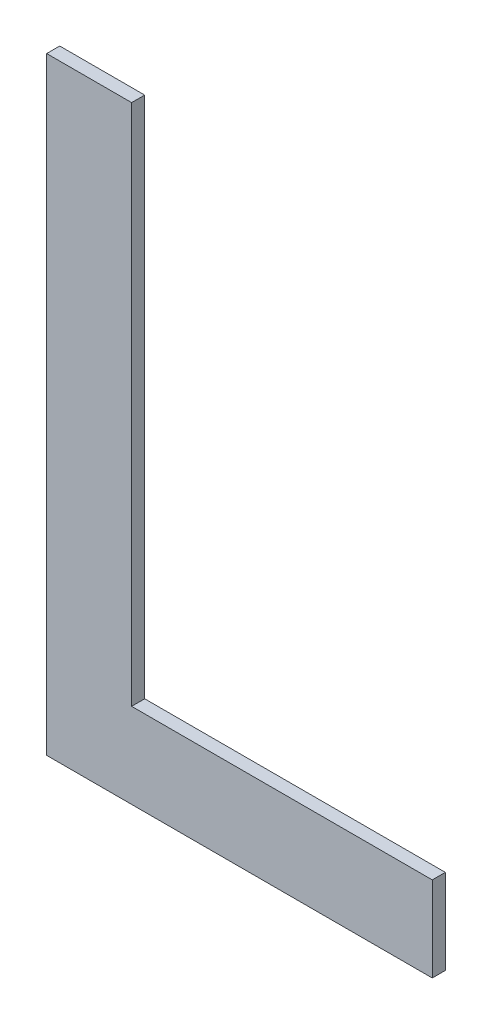
ISO-10303-21;
HEADER;
FILE_DESCRIPTION(('STEP AP214'),'2;1');
FILE_NAME('part.step','',(''),(''),'','','');
FILE_SCHEMA(('AUTOMOTIVE_DESIGN { 1 0 10303 214 1 1 1 1 }'));
ENDSEC;
DATA;
#1=APPLICATION_CONTEXT('core data for automotive mechanical design processes');
#2=APPLICATION_PROTOCOL_DEFINITION('international standard','automotive_design',2000,#1);
#3=PRODUCT_CONTEXT('',#1,'mechanical');
#4=PRODUCT('Part','Part','',(#3));
#5=PRODUCT_RELATED_PRODUCT_CATEGORY('part','',(#4));
#6=PRODUCT_DEFINITION_FORMATION('','',#4);
#7=PRODUCT_DEFINITION_CONTEXT('part definition',#1,'design');
#8=PRODUCT_DEFINITION('design','',#6,#7);
#9=PRODUCT_DEFINITION_SHAPE('','',#8);
#10=(LENGTH_UNIT() NAMED_UNIT(*) SI_UNIT(.MILLI.,.METRE.));
#11=(NAMED_UNIT(*) PLANE_ANGLE_UNIT() SI_UNIT($,.RADIAN.));
#12=(NAMED_UNIT(*) SI_UNIT($,.STERADIAN.) SOLID_ANGLE_UNIT());
#13=UNCERTAINTY_MEASURE_WITH_UNIT(LENGTH_MEASURE(1.E-05),#10,'distance_accuracy_value','');
#14=(GEOMETRIC_REPRESENTATION_CONTEXT(3) GLOBAL_UNCERTAINTY_ASSIGNED_CONTEXT((#13)) GLOBAL_UNIT_ASSIGNED_CONTEXT((#10,
#11,#12)) REPRESENTATION_CONTEXT('',''));
#15=CARTESIAN_POINT('',(0.,0.,0.));
#16=DIRECTION('',(0.,0.,1.));
#17=DIRECTION('',(1.,0.,0.));
#18=AXIS2_PLACEMENT_3D('',#15,#16,#17);
#19=CARTESIAN_POINT('',(-0.29500068,0.46500034,0.));
#20=DIRECTION('',(0.,0.,-1.));
#21=DIRECTION('',(0.,-1.,0.));
#22=AXIS2_PLACEMENT_3D('',#19,#20,#21);
#23=PLANE('',#22);
#24=DIRECTION('',(-1.,0.,0.));
#25=VECTOR('',#24,1.);
#26=CARTESIAN_POINT('',(-0.29500068,-0.4649978,0.));
#27=LINE('',#26,#25);
#28=CARTESIAN_POINT('',(0.29500068,-0.4649978,0.));
#29=VERTEX_POINT('',#28);
#30=CARTESIAN_POINT('',(-0.29500068,-0.4649978,0.));
#31=VERTEX_POINT('',#30);
#32=EDGE_CURVE('E25',#29,#31,#27,.T.);
#33=ORIENTED_EDGE('',*,*,#32,.T.);
#34=DIRECTION('',(0.,1.,0.));
#35=VECTOR('',#34,1.);
#36=CARTESIAN_POINT('',(-0.29500068,0.46500034,0.));
#37=LINE('',#36,#35);
#38=CARTESIAN_POINT('',(-0.29500068,0.46500034,0.));
#39=VERTEX_POINT('',#38);
#40=EDGE_CURVE('E11',#31,#39,#37,.T.);
#41=ORIENTED_EDGE('',*,*,#40,.T.);
#42=DIRECTION('',(1.,0.,0.));
#43=VECTOR('',#42,1.);
#44=CARTESIAN_POINT('',(-0.29500068,0.46500034,0.));
#45=LINE('',#44,#43);
#46=CARTESIAN_POINT('',(-0.16500094,0.46500034,0.));
#47=VERTEX_POINT('',#46);
#48=EDGE_CURVE('E84',#39,#47,#45,.T.);
#49=ORIENTED_EDGE('',*,*,#48,.T.);
#50=DIRECTION('',(0.,-1.,0.));
#51=VECTOR('',#50,1.);
#52=CARTESIAN_POINT('',(-0.16500094,0.46500034,0.));
#53=LINE('',#52,#51);
#54=CARTESIAN_POINT('',(-0.16500094,-0.33499806,0.));
#55=VERTEX_POINT('',#54);
#56=EDGE_CURVE('E82',#47,#55,#53,.T.);
#57=ORIENTED_EDGE('',*,*,#56,.T.);
#58=DIRECTION('',(1.,0.,0.));
#59=VECTOR('',#58,1.);
#60=CARTESIAN_POINT('',(-0.29500068,-0.33499806,0.));
#61=LINE('',#60,#59);
#62=CARTESIAN_POINT('',(0.29500068,-0.33499806,0.));
#63=VERTEX_POINT('',#62);
#64=EDGE_CURVE('E68',#55,#63,#61,.T.);
#65=ORIENTED_EDGE('',*,*,#64,.T.);
#66=DIRECTION('',(0.,-1.,0.));
#67=VECTOR('',#66,1.);
#68=CARTESIAN_POINT('',(0.29500068,0.46500034,0.));
#69=LINE('',#68,#67);
#70=EDGE_CURVE('E120',#63,#29,#69,.T.);
#71=ORIENTED_EDGE('',*,*,#70,.T.);
#72=EDGE_LOOP('',(#33,#41,#49,#57,#65,#71));
#73=FACE_BOUND('',#72,.T.);
#74=ADVANCED_FACE('F17',(#73),#23,.T.);
#75=CARTESIAN_POINT('',(-0.29500068,0.46500034,0.));
#76=DIRECTION('',(1.,0.,0.));
#77=DIRECTION('',(0.,1.,0.));
#78=AXIS2_PLACEMENT_3D('',#75,#76,#77);
#79=PLANE('',#78);
#80=DIRECTION('',(0.,0.,-1.));
#81=VECTOR('',#80,1.);
#82=CARTESIAN_POINT('',(-0.29500068,-0.4649978,0.));
#83=LINE('',#82,#81);
#84=CARTESIAN_POINT('',(-0.29500068,-0.4649978,0.02));
#85=VERTEX_POINT('',#84);
#86=EDGE_CURVE('E127',#85,#31,#83,.T.);
#87=ORIENTED_EDGE('',*,*,#86,.F.);
#88=DIRECTION('',(0.,-1.,0.));
#89=VECTOR('',#88,1.);
#90=CARTESIAN_POINT('',(-0.29500068,0.46500034,0.02));
#91=LINE('',#90,#89);
#92=CARTESIAN_POINT('',(-0.29500068,0.46500034,0.02));
#93=VERTEX_POINT('',#92);
#94=EDGE_CURVE('E109',#93,#85,#91,.T.);
#95=ORIENTED_EDGE('',*,*,#94,.F.);
#96=DIRECTION('',(0.,0.,1.));
#97=VECTOR('',#96,1.);
#98=CARTESIAN_POINT('',(-0.29500068,0.46500034,0.));
#99=LINE('',#98,#97);
#100=EDGE_CURVE('E112',#39,#93,#99,.T.);
#101=ORIENTED_EDGE('',*,*,#100,.F.);
#102=ORIENTED_EDGE('',*,*,#40,.F.);
#103=EDGE_LOOP('',(#87,#95,#101,#102));
#104=FACE_BOUND('',#103,.T.);
#105=ADVANCED_FACE('F138',(#104),#79,.F.);
#106=CARTESIAN_POINT('',(-0.29500068,-0.4649978,0.));
#107=DIRECTION('',(0.,1.,0.));
#108=DIRECTION('',(1.,0.,0.));
#109=AXIS2_PLACEMENT_3D('',#106,#107,#108);
#110=PLANE('',#109);
#111=DIRECTION('',(0.,0.,-1.));
#112=VECTOR('',#111,1.);
#113=CARTESIAN_POINT('',(0.29500068,-0.4649978,0.));
#114=LINE('',#113,#112);
#115=CARTESIAN_POINT('',(0.29500068,-0.4649978,0.02));
#116=VERTEX_POINT('',#115);
#117=EDGE_CURVE('E79',#116,#29,#114,.T.);
#118=ORIENTED_EDGE('',*,*,#117,.F.);
#119=DIRECTION('',(1.,0.,0.));
#120=VECTOR('',#119,1.);
#121=CARTESIAN_POINT('',(-0.29500068,-0.4649978,0.02));
#122=LINE('',#121,#120);
#123=EDGE_CURVE('E136',#85,#116,#122,.T.);
#124=ORIENTED_EDGE('',*,*,#123,.F.);
#125=ORIENTED_EDGE('',*,*,#86,.T.);
#126=ORIENTED_EDGE('',*,*,#32,.F.);
#127=EDGE_LOOP('',(#118,#124,#125,#126));
#128=FACE_BOUND('',#127,.T.);
#129=ADVANCED_FACE('F133',(#128),#110,.F.);
#130=CARTESIAN_POINT('',(0.29500068,-0.4649978,0.));
#131=DIRECTION('',(-1.,0.,0.));
#132=DIRECTION('',(0.,0.,1.));
#133=AXIS2_PLACEMENT_3D('',#130,#131,#132);
#134=PLANE('',#133);
#135=DIRECTION('',(0.,0.,-1.));
#136=VECTOR('',#135,1.);
#137=CARTESIAN_POINT('',(0.29500068,-0.33499806,0.));
#138=LINE('',#137,#136);
#139=CARTESIAN_POINT('',(0.29500068,-0.33499806,0.02));
#140=VERTEX_POINT('',#139);
#141=EDGE_CURVE('E76',#140,#63,#138,.T.);
#142=ORIENTED_EDGE('',*,*,#141,.F.);
#143=DIRECTION('',(0.,1.,0.));
#144=VECTOR('',#143,1.);
#145=CARTESIAN_POINT('',(0.29500068,-0.4649978,0.02));
#146=LINE('',#145,#144);
#147=EDGE_CURVE('E162',#116,#140,#146,.T.);
#148=ORIENTED_EDGE('',*,*,#147,.F.);
#149=ORIENTED_EDGE('',*,*,#117,.T.);
#150=ORIENTED_EDGE('',*,*,#70,.F.);
#151=EDGE_LOOP('',(#142,#148,#149,#150));
#152=FACE_BOUND('',#151,.T.);
#153=ADVANCED_FACE('F163',(#152),#134,.F.);
#154=CARTESIAN_POINT('',(0.29500068,-0.33499806,0.));
#155=DIRECTION('',(0.,-1.,0.));
#156=DIRECTION('',(0.,0.,-1.));
#157=AXIS2_PLACEMENT_3D('',#154,#155,#156);
#158=PLANE('',#157);
#159=DIRECTION('',(0.,0.,-1.));
#160=VECTOR('',#159,1.);
#161=CARTESIAN_POINT('',(-0.16500094,-0.33499806,0.));
#162=LINE('',#161,#160);
#163=CARTESIAN_POINT('',(-0.16500094,-0.33499806,0.02));
#164=VERTEX_POINT('',#163);
#165=EDGE_CURVE('E73',#164,#55,#162,.T.);
#166=ORIENTED_EDGE('',*,*,#165,.F.);
#167=DIRECTION('',(-1.,0.,0.));
#168=VECTOR('',#167,1.);
#169=CARTESIAN_POINT('',(0.29500068,-0.33499806,0.02));
#170=LINE('',#169,#168);
#171=EDGE_CURVE('E165',#140,#164,#170,.T.);
#172=ORIENTED_EDGE('',*,*,#171,.F.);
#173=ORIENTED_EDGE('',*,*,#141,.T.);
#174=ORIENTED_EDGE('',*,*,#64,.F.);
#175=EDGE_LOOP('',(#166,#172,#173,#174));
#176=FACE_BOUND('',#175,.T.);
#177=ADVANCED_FACE('F70',(#176),#158,.F.);
#178=CARTESIAN_POINT('',(-0.16500094,-0.33499806,0.));
#179=DIRECTION('',(-1.,0.,0.));
#180=DIRECTION('',(0.,0.,1.));
#181=AXIS2_PLACEMENT_3D('',#178,#179,#180);
#182=PLANE('',#181);
#183=DIRECTION('',(0.,0.,-1.));
#184=VECTOR('',#183,1.);
#185=CARTESIAN_POINT('',(-0.16500094,0.46500034,0.));
#186=LINE('',#185,#184);
#187=CARTESIAN_POINT('',(-0.16500094,0.46500034,0.02));
#188=VERTEX_POINT('',#187);
#189=EDGE_CURVE('E100',#188,#47,#186,.T.);
#190=ORIENTED_EDGE('',*,*,#189,.F.);
#191=DIRECTION('',(0.,1.,0.));
#192=VECTOR('',#191,1.);
#193=CARTESIAN_POINT('',(-0.16500094,-0.33499806,0.02));
#194=LINE('',#193,#192);
#195=EDGE_CURVE('E92',#164,#188,#194,.T.);
#196=ORIENTED_EDGE('',*,*,#195,.F.);
#197=ORIENTED_EDGE('',*,*,#165,.T.);
#198=ORIENTED_EDGE('',*,*,#56,.F.);
#199=EDGE_LOOP('',(#190,#196,#197,#198));
#200=FACE_BOUND('',#199,.T.);
#201=ADVANCED_FACE('F90',(#200),#182,.F.);
#202=CARTESIAN_POINT('',(-0.16500094,0.46500034,0.));
#203=DIRECTION('',(0.,-1.,0.));
#204=DIRECTION('',(0.,0.,-1.));
#205=AXIS2_PLACEMENT_3D('',#202,#203,#204);
#206=PLANE('',#205);
#207=ORIENTED_EDGE('',*,*,#100,.T.);
#208=DIRECTION('',(-1.,0.,0.));
#209=VECTOR('',#208,1.);
#210=CARTESIAN_POINT('',(-0.16500094,0.46500034,0.02));
#211=LINE('',#210,#209);
#212=EDGE_CURVE('E105',#188,#93,#211,.T.);
#213=ORIENTED_EDGE('',*,*,#212,.F.);
#214=ORIENTED_EDGE('',*,*,#189,.T.);
#215=ORIENTED_EDGE('',*,*,#48,.F.);
#216=EDGE_LOOP('',(#207,#213,#214,#215));
#217=FACE_BOUND('',#216,.T.);
#218=ADVANCED_FACE('F150',(#217),#206,.F.);
#219=CARTESIAN_POINT('',(-0.29500068,0.46500034,0.02));
#220=DIRECTION('',(0.,0.,-1.));
#221=DIRECTION('',(0.,-1.,0.));
#222=AXIS2_PLACEMENT_3D('',#219,#220,#221);
#223=PLANE('',#222);
#224=ORIENTED_EDGE('',*,*,#123,.T.);
#225=ORIENTED_EDGE('',*,*,#147,.T.);
#226=ORIENTED_EDGE('',*,*,#171,.T.);
#227=ORIENTED_EDGE('',*,*,#195,.T.);
#228=ORIENTED_EDGE('',*,*,#212,.T.);
#229=ORIENTED_EDGE('',*,*,#94,.T.);
#230=EDGE_LOOP('',(#224,#225,#226,#227,#228,#229));
#231=FACE_BOUND('',#230,.T.);
#232=ADVANCED_FACE('F143',(#231),#223,.F.);
#233=CLOSED_SHELL('',(#74,#105,#129,#153,#177,#201,#218,#232));
#234=MANIFOLD_SOLID_BREP('B1',#233);
#235=ADVANCED_BREP_SHAPE_REPRESENTATION('',(#18,#234),#14);
#236=SHAPE_DEFINITION_REPRESENTATION(#9,#235);
ENDSEC;
END-ISO-10303-21;
